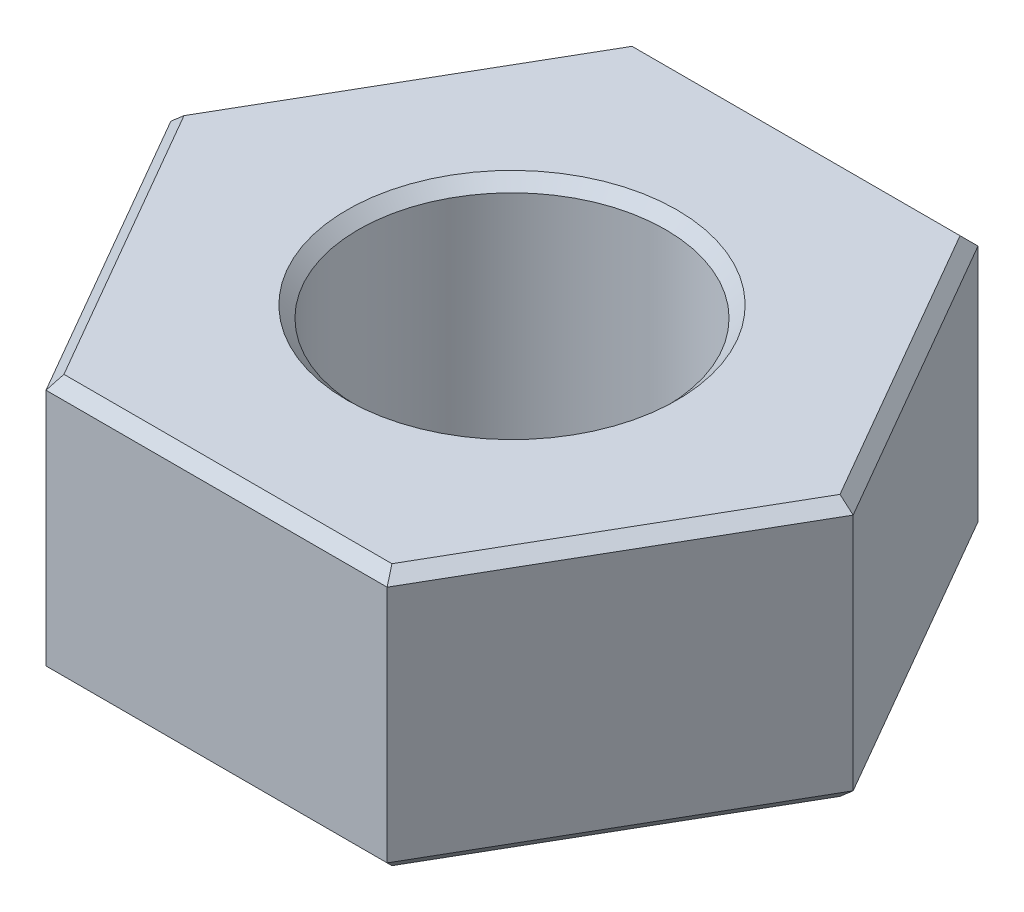
ISO-10303-21;
HEADER;
FILE_DESCRIPTION(('STEP AP214'),'2;1');
FILE_NAME('part.step','',(''),(''),'','','');
FILE_SCHEMA(('AUTOMOTIVE_DESIGN { 1 0 10303 214 1 1 1 1 }'));
ENDSEC;
DATA;
#1=APPLICATION_CONTEXT('core data for automotive mechanical design processes');
#2=APPLICATION_PROTOCOL_DEFINITION('international standard','automotive_design',2000,#1);
#3=PRODUCT_CONTEXT('',#1,'mechanical');
#4=PRODUCT('Part','Part','',(#3));
#5=PRODUCT_RELATED_PRODUCT_CATEGORY('part','',(#4));
#6=PRODUCT_DEFINITION_FORMATION('','',#4);
#7=PRODUCT_DEFINITION_CONTEXT('part definition',#1,'design');
#8=PRODUCT_DEFINITION('design','',#6,#7);
#9=PRODUCT_DEFINITION_SHAPE('','',#8);
#10=(LENGTH_UNIT() NAMED_UNIT(*) SI_UNIT(.MILLI.,.METRE.));
#11=(NAMED_UNIT(*) PLANE_ANGLE_UNIT() SI_UNIT($,.RADIAN.));
#12=(NAMED_UNIT(*) SI_UNIT($,.STERADIAN.) SOLID_ANGLE_UNIT());
#13=UNCERTAINTY_MEASURE_WITH_UNIT(LENGTH_MEASURE(1.E-05),#10,'distance_accuracy_value','');
#14=(GEOMETRIC_REPRESENTATION_CONTEXT(3) GLOBAL_UNCERTAINTY_ASSIGNED_CONTEXT((#13)) GLOBAL_UNIT_ASSIGNED_CONTEXT((#10,
#11,#12)) REPRESENTATION_CONTEXT('',''));
#15=CARTESIAN_POINT('',(0.,0.,0.));
#16=DIRECTION('',(0.,0.,1.));
#17=DIRECTION('',(1.,0.,0.));
#18=AXIS2_PLACEMENT_3D('',#15,#16,#17);
#19=CARTESIAN_POINT('',(0.,2.3,0.));
#20=DIRECTION('',(0.,1.,0.));
#21=DIRECTION('',(0.,0.,1.));
#22=AXIS2_PLACEMENT_3D('',#19,#20,#21);
#23=PLANE('',#22);
#24=CARTESIAN_POINT('',(0.,2.3,0.));
#25=DIRECTION('',(0.,1.,0.));
#26=DIRECTION('',(0.,0.,1.));
#27=AXIS2_PLACEMENT_3D('',#24,#25,#26);
#28=CIRCLE('',#27,1.45);
#29=CARTESIAN_POINT('',(0.,2.3,1.45));
#30=VERTEX_POINT('',#29);
#31=EDGE_CURVE('E11',#30,#30,#28,.F.);
#32=ORIENTED_EDGE('',*,*,#31,.T.);
#33=EDGE_LOOP('',(#32));
#34=FACE_BOUND('',#33,.T.);
#35=DIRECTION('',(-0.5,0.,0.866025403784439));
#36=VECTOR('',#35,1.);
#37=CARTESIAN_POINT('',(-2.91339745962156,2.3,0.0500000000000001));
#38=LINE('',#37,#36);
#39=CARTESIAN_POINT('',(-1.44226497308104,2.3,-2.49807621135332));
#40=VERTEX_POINT('',#39);
#41=CARTESIAN_POINT('',(-2.88452994616207,2.3,0.));
#42=VERTEX_POINT('',#41);
#43=EDGE_CURVE('E52',#40,#42,#38,.T.);
#44=ORIENTED_EDGE('',*,*,#43,.T.);
#45=DIRECTION('',(0.5,0.,0.866025403784439));
#46=VECTOR('',#45,1.);
#47=CARTESIAN_POINT('',(-1.41339745962156,2.3,2.54807621135332));
#48=LINE('',#47,#46);
#49=CARTESIAN_POINT('',(-1.44226497308104,2.3,2.49807621135332));
#50=VERTEX_POINT('',#49);
#51=EDGE_CURVE('E44',#42,#50,#48,.T.);
#52=ORIENTED_EDGE('',*,*,#51,.T.);
#53=DIRECTION('',(1.,0.,0.));
#54=VECTOR('',#53,1.);
#55=CARTESIAN_POINT('',(1.5,2.3,2.49807621135332));
#56=LINE('',#55,#54);
#57=CARTESIAN_POINT('',(1.44226497308104,2.3,2.49807621135332));
#58=VERTEX_POINT('',#57);
#59=EDGE_CURVE('E191',#50,#58,#56,.T.);
#60=ORIENTED_EDGE('',*,*,#59,.T.);
#61=DIRECTION('',(0.5,0.,-0.866025403784439));
#62=VECTOR('',#61,1.);
#63=CARTESIAN_POINT('',(2.91339745962156,2.3,-0.0499999999999996));
#64=LINE('',#63,#62);
#65=CARTESIAN_POINT('',(2.88452994616207,2.3,0.));
#66=VERTEX_POINT('',#65);
#67=EDGE_CURVE('E193',#58,#66,#64,.T.);
#68=ORIENTED_EDGE('',*,*,#67,.T.);
#69=DIRECTION('',(-0.5,0.,-0.866025403784439));
#70=VECTOR('',#69,1.);
#71=CARTESIAN_POINT('',(1.41339745962156,2.3,-2.54807621135332));
#72=LINE('',#71,#70);
#73=CARTESIAN_POINT('',(1.44226497308104,2.3,-2.49807621135332));
#74=VERTEX_POINT('',#73);
#75=EDGE_CURVE('E195',#66,#74,#72,.T.);
#76=ORIENTED_EDGE('',*,*,#75,.T.);
#77=DIRECTION('',(-1.,0.,0.));
#78=VECTOR('',#77,1.);
#79=CARTESIAN_POINT('',(-1.5,2.3,-2.49807621135332));
#80=LINE('',#79,#78);
#81=EDGE_CURVE('E57',#74,#40,#80,.T.);
#82=ORIENTED_EDGE('',*,*,#81,.T.);
#83=EDGE_LOOP('',(#44,#52,#60,#68,#76,#82));
#84=FACE_BOUND('',#83,.T.);
#85=ADVANCED_FACE('F35',(#34,#84),#23,.T.);
#86=CARTESIAN_POINT('',(0.,0.,0.));
#87=DIRECTION('',(0.,1.,0.));
#88=DIRECTION('',(0.,0.,1.));
#89=AXIS2_PLACEMENT_3D('',#86,#87,#88);
#90=PLANE('',#89);
#91=CARTESIAN_POINT('',(0.,0.,0.));
#92=DIRECTION('',(0.,1.,0.));
#93=DIRECTION('',(0.,0.,1.));
#94=AXIS2_PLACEMENT_3D('',#91,#92,#93);
#95=CIRCLE('',#94,1.45);
#96=CARTESIAN_POINT('',(0.,0.,1.45));
#97=VERTEX_POINT('',#96);
#98=EDGE_CURVE('E153',#97,#97,#95,.T.);
#99=ORIENTED_EDGE('',*,*,#98,.T.);
#100=EDGE_LOOP('',(#99));
#101=FACE_BOUND('',#100,.T.);
#102=DIRECTION('',(1.,0.,0.));
#103=VECTOR('',#102,1.);
#104=CARTESIAN_POINT('',(0.,0.,-2.49807621135332));
#105=LINE('',#104,#103);
#106=CARTESIAN_POINT('',(-1.44226497308104,0.,-2.49807621135332));
#107=VERTEX_POINT('',#106);
#108=CARTESIAN_POINT('',(1.44226497308104,0.,-2.49807621135332));
#109=VERTEX_POINT('',#108);
#110=EDGE_CURVE('E152',#107,#109,#105,.T.);
#111=ORIENTED_EDGE('',*,*,#110,.T.);
#112=DIRECTION('',(0.5,0.,0.866025403784439));
#113=VECTOR('',#112,1.);
#114=CARTESIAN_POINT('',(2.16339745962156,0.,-1.24903810567666));
#115=LINE('',#114,#113);
#116=CARTESIAN_POINT('',(2.88452994616207,0.,0.));
#117=VERTEX_POINT('',#116);
#118=EDGE_CURVE('E131',#109,#117,#115,.T.);
#119=ORIENTED_EDGE('',*,*,#118,.T.);
#120=DIRECTION('',(-0.5,0.,0.866025403784439));
#121=VECTOR('',#120,1.);
#122=CARTESIAN_POINT('',(2.16339745962156,0.,1.24903810567666));
#123=LINE('',#122,#121);
#124=CARTESIAN_POINT('',(1.44226497308104,0.,2.49807621135332));
#125=VERTEX_POINT('',#124);
#126=EDGE_CURVE('E141',#117,#125,#123,.T.);
#127=ORIENTED_EDGE('',*,*,#126,.T.);
#128=DIRECTION('',(-1.,0.,0.));
#129=VECTOR('',#128,1.);
#130=CARTESIAN_POINT('',(0.,0.,2.49807621135331));
#131=LINE('',#130,#129);
#132=CARTESIAN_POINT('',(-1.44226497308104,0.,2.49807621135331));
#133=VERTEX_POINT('',#132);
#134=EDGE_CURVE('E147',#125,#133,#131,.T.);
#135=ORIENTED_EDGE('',*,*,#134,.T.);
#136=DIRECTION('',(-0.5,0.,-0.866025403784439));
#137=VECTOR('',#136,1.);
#138=CARTESIAN_POINT('',(-2.16339745962155,0.,1.24903810567666));
#139=LINE('',#138,#137);
#140=CARTESIAN_POINT('',(-2.88452994616207,0.,0.));
#141=VERTEX_POINT('',#140);
#142=EDGE_CURVE('E251',#133,#141,#139,.T.);
#143=ORIENTED_EDGE('',*,*,#142,.T.);
#144=DIRECTION('',(0.5,0.,-0.866025403784439));
#145=VECTOR('',#144,1.);
#146=CARTESIAN_POINT('',(-2.16339745962156,0.,-1.24903810567666));
#147=LINE('',#146,#145);
#148=EDGE_CURVE('E158',#141,#107,#147,.T.);
#149=ORIENTED_EDGE('',*,*,#148,.T.);
#150=EDGE_LOOP('',(#111,#119,#127,#135,#143,#149));
#151=FACE_BOUND('',#150,.T.);
#152=ADVANCED_FACE('F150',(#101,#151),#90,.F.);
#153=CARTESIAN_POINT('',(1.5,2.3,2.59807621135332));
#154=DIRECTION('',(-0.866025403784439,0.,-0.5));
#155=DIRECTION('',(-0.5,0.,0.866025403784439));
#156=AXIS2_PLACEMENT_3D('',#153,#154,#155);
#157=PLANE('',#156);
#158=DIRECTION('',(0.,-1.,0.));
#159=VECTOR('',#158,1.);
#160=CARTESIAN_POINT('',(1.5,2.3,2.59807621135332));
#161=LINE('',#160,#159);
#162=CARTESIAN_POINT('',(1.5,2.2,2.59807621135332));
#163=VERTEX_POINT('',#162);
#164=CARTESIAN_POINT('',(1.5,0.1,2.59807621135332));
#165=VERTEX_POINT('',#164);
#166=EDGE_CURVE('E210',#163,#165,#161,.T.);
#167=ORIENTED_EDGE('',*,*,#166,.T.);
#168=DIRECTION('',(0.5,0.,-0.866025403784439));
#169=VECTOR('',#168,1.);
#170=CARTESIAN_POINT('',(1.5,0.1,2.59807621135332));
#171=LINE('',#170,#169);
#172=CARTESIAN_POINT('',(3.,0.1,0.));
#173=VERTEX_POINT('',#172);
#174=EDGE_CURVE('E189',#165,#173,#171,.T.);
#175=ORIENTED_EDGE('',*,*,#174,.T.);
#176=DIRECTION('',(0.,-1.,0.));
#177=VECTOR('',#176,1.);
#178=CARTESIAN_POINT('',(3.,2.3,0.));
#179=LINE('',#178,#177);
#180=CARTESIAN_POINT('',(3.,2.2,0.));
#181=VERTEX_POINT('',#180);
#182=EDGE_CURVE('E148',#181,#173,#179,.T.);
#183=ORIENTED_EDGE('',*,*,#182,.F.);
#184=DIRECTION('',(-0.5,0.,0.866025403784439));
#185=VECTOR('',#184,1.);
#186=CARTESIAN_POINT('',(1.5,2.2,2.59807621135332));
#187=LINE('',#186,#185);
#188=EDGE_CURVE('E187',#181,#163,#187,.T.);
#189=ORIENTED_EDGE('',*,*,#188,.T.);
#190=EDGE_LOOP('',(#167,#175,#183,#189));
#191=FACE_BOUND('',#190,.T.);
#192=ADVANCED_FACE('F243',(#191),#157,.F.);
#193=CARTESIAN_POINT('',(3.,2.3,0.));
#194=DIRECTION('',(-0.866025403784439,0.,0.5));
#195=DIRECTION('',(0.5,0.,0.866025403784439));
#196=AXIS2_PLACEMENT_3D('',#193,#194,#195);
#197=PLANE('',#196);
#198=ORIENTED_EDGE('',*,*,#182,.T.);
#199=DIRECTION('',(-0.5,0.,-0.866025403784439));
#200=VECTOR('',#199,1.);
#201=CARTESIAN_POINT('',(3.,0.1,0.));
#202=LINE('',#201,#200);
#203=CARTESIAN_POINT('',(1.5,0.1,-2.59807621135332));
#204=VERTEX_POINT('',#203);
#205=EDGE_CURVE('E134',#173,#204,#202,.T.);
#206=ORIENTED_EDGE('',*,*,#205,.T.);
#207=DIRECTION('',(0.,-1.,0.));
#208=VECTOR('',#207,1.);
#209=CARTESIAN_POINT('',(1.5,2.3,-2.59807621135332));
#210=LINE('',#209,#208);
#211=CARTESIAN_POINT('',(1.5,2.2,-2.59807621135332));
#212=VERTEX_POINT('',#211);
#213=EDGE_CURVE('E240',#212,#204,#210,.T.);
#214=ORIENTED_EDGE('',*,*,#213,.F.);
#215=DIRECTION('',(0.5,0.,0.866025403784439));
#216=VECTOR('',#215,1.);
#217=CARTESIAN_POINT('',(3.,2.2,0.));
#218=LINE('',#217,#216);
#219=EDGE_CURVE('E167',#212,#181,#218,.T.);
#220=ORIENTED_EDGE('',*,*,#219,.T.);
#221=EDGE_LOOP('',(#198,#206,#214,#220));
#222=FACE_BOUND('',#221,.T.);
#223=ADVANCED_FACE('F238',(#222),#197,.F.);
#224=CARTESIAN_POINT('',(1.5,2.3,-2.59807621135332));
#225=DIRECTION('',(0.,0.,1.));
#226=DIRECTION('',(1.,0.,0.));
#227=AXIS2_PLACEMENT_3D('',#224,#225,#226);
#228=PLANE('',#227);
#229=ORIENTED_EDGE('',*,*,#213,.T.);
#230=DIRECTION('',(-1.,0.,0.));
#231=VECTOR('',#230,1.);
#232=CARTESIAN_POINT('',(1.5,0.1,-2.59807621135332));
#233=LINE('',#232,#231);
#234=CARTESIAN_POINT('',(-1.5,0.1,-2.59807621135332));
#235=VERTEX_POINT('',#234);
#236=EDGE_CURVE('E172',#204,#235,#233,.T.);
#237=ORIENTED_EDGE('',*,*,#236,.T.);
#238=DIRECTION('',(0.,-1.,0.));
#239=VECTOR('',#238,1.);
#240=CARTESIAN_POINT('',(-1.5,2.3,-2.59807621135332));
#241=LINE('',#240,#239);
#242=CARTESIAN_POINT('',(-1.5,2.2,-2.59807621135332));
#243=VERTEX_POINT('',#242);
#244=EDGE_CURVE('E246',#243,#235,#241,.T.);
#245=ORIENTED_EDGE('',*,*,#244,.F.);
#246=DIRECTION('',(1.,0.,0.));
#247=VECTOR('',#246,1.);
#248=CARTESIAN_POINT('',(1.5,2.2,-2.59807621135332));
#249=LINE('',#248,#247);
#250=EDGE_CURVE('E170',#243,#212,#249,.T.);
#251=ORIENTED_EDGE('',*,*,#250,.T.);
#252=EDGE_LOOP('',(#229,#237,#245,#251));
#253=FACE_BOUND('',#252,.T.);
#254=ADVANCED_FACE('F265',(#253),#228,.F.);
#255=CARTESIAN_POINT('',(-1.5,2.3,-2.59807621135332));
#256=DIRECTION('',(0.866025403784439,0.,0.5));
#257=DIRECTION('',(0.5,0.,-0.866025403784439));
#258=AXIS2_PLACEMENT_3D('',#255,#256,#257);
#259=PLANE('',#258);
#260=ORIENTED_EDGE('',*,*,#244,.T.);
#261=DIRECTION('',(-0.5,0.,0.866025403784439));
#262=VECTOR('',#261,1.);
#263=CARTESIAN_POINT('',(-1.5,0.1,-2.59807621135332));
#264=LINE('',#263,#262);
#265=CARTESIAN_POINT('',(-3.,0.1,0.));
#266=VERTEX_POINT('',#265);
#267=EDGE_CURVE('E176',#235,#266,#264,.T.);
#268=ORIENTED_EDGE('',*,*,#267,.T.);
#269=DIRECTION('',(0.,-1.,0.));
#270=VECTOR('',#269,1.);
#271=CARTESIAN_POINT('',(-3.,2.3,0.));
#272=LINE('',#271,#270);
#273=CARTESIAN_POINT('',(-3.,2.2,0.));
#274=VERTEX_POINT('',#273);
#275=EDGE_CURVE('E267',#274,#266,#272,.T.);
#276=ORIENTED_EDGE('',*,*,#275,.F.);
#277=DIRECTION('',(0.5,0.,-0.866025403784439));
#278=VECTOR('',#277,1.);
#279=CARTESIAN_POINT('',(-1.5,2.2,-2.59807621135332));
#280=LINE('',#279,#278);
#281=EDGE_CURVE('E174',#274,#243,#280,.T.);
#282=ORIENTED_EDGE('',*,*,#281,.T.);
#283=EDGE_LOOP('',(#260,#268,#276,#282));
#284=FACE_BOUND('',#283,.T.);
#285=ADVANCED_FACE('F298',(#284),#259,.F.);
#286=CARTESIAN_POINT('',(-3.,2.3,0.));
#287=DIRECTION('',(0.866025403784439,0.,-0.5));
#288=DIRECTION('',(-0.5,0.,-0.866025403784439));
#289=AXIS2_PLACEMENT_3D('',#286,#287,#288);
#290=PLANE('',#289);
#291=ORIENTED_EDGE('',*,*,#275,.T.);
#292=DIRECTION('',(0.5,0.,0.866025403784439));
#293=VECTOR('',#292,1.);
#294=CARTESIAN_POINT('',(-3.,0.1,0.));
#295=LINE('',#294,#293);
#296=CARTESIAN_POINT('',(-1.5,0.1,2.59807621135332));
#297=VERTEX_POINT('',#296);
#298=EDGE_CURVE('E181',#266,#297,#295,.T.);
#299=ORIENTED_EDGE('',*,*,#298,.T.);
#300=DIRECTION('',(0.,-1.,0.));
#301=VECTOR('',#300,1.);
#302=CARTESIAN_POINT('',(-1.5,2.3,2.59807621135332));
#303=LINE('',#302,#301);
#304=CARTESIAN_POINT('',(-1.5,2.2,2.59807621135332));
#305=VERTEX_POINT('',#304);
#306=EDGE_CURVE('E269',#305,#297,#303,.T.);
#307=ORIENTED_EDGE('',*,*,#306,.F.);
#308=DIRECTION('',(-0.5,0.,-0.866025403784439));
#309=VECTOR('',#308,1.);
#310=CARTESIAN_POINT('',(-3.,2.2,0.));
#311=LINE('',#310,#309);
#312=EDGE_CURVE('E178',#305,#274,#311,.T.);
#313=ORIENTED_EDGE('',*,*,#312,.T.);
#314=EDGE_LOOP('',(#291,#299,#307,#313));
#315=FACE_BOUND('',#314,.T.);
#316=ADVANCED_FACE('F285',(#315),#290,.F.);
#317=CARTESIAN_POINT('',(-1.5,2.3,2.59807621135332));
#318=DIRECTION('',(0.,0.,-1.));
#319=DIRECTION('',(-1.,0.,0.));
#320=AXIS2_PLACEMENT_3D('',#317,#318,#319);
#321=PLANE('',#320);
#322=ORIENTED_EDGE('',*,*,#306,.T.);
#323=DIRECTION('',(1.,0.,0.));
#324=VECTOR('',#323,1.);
#325=CARTESIAN_POINT('',(-1.5,0.1,2.59807621135332));
#326=LINE('',#325,#324);
#327=EDGE_CURVE('E185',#297,#165,#326,.T.);
#328=ORIENTED_EDGE('',*,*,#327,.T.);
#329=ORIENTED_EDGE('',*,*,#166,.F.);
#330=DIRECTION('',(-1.,0.,0.));
#331=VECTOR('',#330,1.);
#332=CARTESIAN_POINT('',(-1.5,2.2,2.59807621135332));
#333=LINE('',#332,#331);
#334=EDGE_CURVE('E183',#163,#305,#333,.T.);
#335=ORIENTED_EDGE('',*,*,#334,.T.);
#336=EDGE_LOOP('',(#322,#328,#329,#335));
#337=FACE_BOUND('',#336,.T.);
#338=ADVANCED_FACE('F288',(#337),#321,.F.);
#339=CARTESIAN_POINT('',(0.,2.3,0.));
#340=DIRECTION('',(0.,-1.,0.));
#341=DIRECTION('',(0.,0.,-1.));
#342=AXIS2_PLACEMENT_3D('',#339,#340,#341);
#343=CYLINDRICAL_SURFACE('',#342,1.35);
#344=CARTESIAN_POINT('',(0.,0.1,0.));
#345=DIRECTION('',(0.,1.,0.));
#346=DIRECTION('',(0.,0.,1.));
#347=AXIS2_PLACEMENT_3D('',#344,#345,#346);
#348=CIRCLE('',#347,1.35);
#349=CARTESIAN_POINT('',(0.,0.1,1.35));
#350=VERTEX_POINT('',#349);
#351=EDGE_CURVE('E164',#350,#350,#348,.F.);
#352=ORIENTED_EDGE('',*,*,#351,.T.);
#353=EDGE_LOOP('',(#352));
#354=FACE_BOUND('',#353,.T.);
#355=CARTESIAN_POINT('',(0.,2.2,0.));
#356=DIRECTION('',(0.,1.,0.));
#357=DIRECTION('',(0.,0.,1.));
#358=AXIS2_PLACEMENT_3D('',#355,#356,#357);
#359=CIRCLE('',#358,1.35);
#360=CARTESIAN_POINT('',(0.,2.2,1.35));
#361=VERTEX_POINT('',#360);
#362=EDGE_CURVE('E156',#361,#361,#359,.T.);
#363=ORIENTED_EDGE('',*,*,#362,.T.);
#364=EDGE_LOOP('',(#363));
#365=FACE_BOUND('',#364,.T.);
#366=ADVANCED_FACE('F319',(#354,#365),#343,.F.);
#367=CARTESIAN_POINT('',(0.,0.,0.));
#368=DIRECTION('',(0.,-1.,0.));
#369=DIRECTION('',(0.,0.,-1.));
#370=AXIS2_PLACEMENT_3D('',#367,#368,#369);
#371=CONICAL_SURFACE('',#370,1.45,0.785398163397446);
#372=ORIENTED_EDGE('',*,*,#351,.F.);
#373=EDGE_LOOP('',(#372));
#374=FACE_BOUND('',#373,.T.);
#375=ORIENTED_EDGE('',*,*,#98,.F.);
#376=EDGE_LOOP('',(#375));
#377=FACE_BOUND('',#376,.T.);
#378=ADVANCED_FACE('F333',(#374,#377),#371,.F.);
#379=CARTESIAN_POINT('',(-3.,0.1,0.));
#380=DIRECTION('',(0.612372435695794,0.707106781186549,-0.353553390593273));
#381=DIRECTION('',(0.5,0.,0.866025403784439));
#382=AXIS2_PLACEMENT_3D('',#379,#380,#381);
#383=PLANE('',#382);
#384=DIRECTION('',(0.755928946018456,-0.654653670707976,0.));
#385=VECTOR('',#384,1.);
#386=CARTESIAN_POINT('',(-3.,0.1,0.));
#387=LINE('',#386,#385);
#388=EDGE_CURVE('E204',#141,#266,#387,.F.);
#389=ORIENTED_EDGE('',*,*,#388,.F.);
#390=ORIENTED_EDGE('',*,*,#142,.F.);
#391=DIRECTION('',(0.377964473009228,-0.654653670707976,-0.654653670707978));
#392=VECTOR('',#391,1.);
#393=CARTESIAN_POINT('',(-1.5,0.1,2.59807621135332));
#394=LINE('',#393,#392);
#395=EDGE_CURVE('E207',#297,#133,#394,.T.);
#396=ORIENTED_EDGE('',*,*,#395,.F.);
#397=ORIENTED_EDGE('',*,*,#298,.F.);
#398=EDGE_LOOP('',(#389,#390,#396,#397));
#399=FACE_BOUND('',#398,.T.);
#400=ADVANCED_FACE('F281',(#399),#383,.F.);
#401=CARTESIAN_POINT('',(-1.5,0.1,2.59807621135332));
#402=DIRECTION('',(0.,0.707106781186548,-0.707106781186547));
#403=DIRECTION('',(1.,0.,0.));
#404=AXIS2_PLACEMENT_3D('',#401,#402,#403);
#405=PLANE('',#404);
#406=ORIENTED_EDGE('',*,*,#395,.T.);
#407=ORIENTED_EDGE('',*,*,#134,.F.);
#408=DIRECTION('',(-0.377964473009223,-0.654653670707977,-0.654653670707979));
#409=VECTOR('',#408,1.);
#410=CARTESIAN_POINT('',(1.5,0.1,2.59807621135332));
#411=LINE('',#410,#409);
#412=EDGE_CURVE('E144',#165,#125,#411,.T.);
#413=ORIENTED_EDGE('',*,*,#412,.F.);
#414=ORIENTED_EDGE('',*,*,#327,.F.);
#415=EDGE_LOOP('',(#406,#407,#413,#414));
#416=FACE_BOUND('',#415,.T.);
#417=ADVANCED_FACE('F278',(#416),#405,.F.);
#418=CARTESIAN_POINT('',(-1.5,0.1,-2.59807621135332));
#419=DIRECTION('',(0.612372435695794,0.707106781186549,0.353553390593273));
#420=DIRECTION('',(-0.5,0.,0.866025403784439));
#421=AXIS2_PLACEMENT_3D('',#418,#419,#420);
#422=PLANE('',#421);
#423=ORIENTED_EDGE('',*,*,#388,.T.);
#424=ORIENTED_EDGE('',*,*,#267,.F.);
#425=DIRECTION('',(0.37796447300923,-0.654653670707977,0.654653670707976));
#426=VECTOR('',#425,1.);
#427=CARTESIAN_POINT('',(-1.5,0.1,-2.59807621135332));
#428=LINE('',#427,#426);
#429=EDGE_CURVE('E137',#107,#235,#428,.F.);
#430=ORIENTED_EDGE('',*,*,#429,.F.);
#431=ORIENTED_EDGE('',*,*,#148,.F.);
#432=EDGE_LOOP('',(#423,#424,#430,#431));
#433=FACE_BOUND('',#432,.T.);
#434=ADVANCED_FACE('F258',(#433),#422,.F.);
#435=CARTESIAN_POINT('',(1.5,0.1,2.59807621135332));
#436=DIRECTION('',(-0.612372435695796,0.707106781186546,-0.353553390593274));
#437=DIRECTION('',(0.5,0.,-0.866025403784439));
#438=AXIS2_PLACEMENT_3D('',#435,#436,#437);
#439=PLANE('',#438);
#440=ORIENTED_EDGE('',*,*,#412,.T.);
#441=ORIENTED_EDGE('',*,*,#126,.F.);
#442=DIRECTION('',(0.755928946018453,0.654653670707979,0.));
#443=VECTOR('',#442,1.);
#444=CARTESIAN_POINT('',(2.14285714285715,-0.64230748895809,0.));
#445=LINE('',#444,#443);
#446=EDGE_CURVE('E127',#173,#117,#445,.F.);
#447=ORIENTED_EDGE('',*,*,#446,.F.);
#448=ORIENTED_EDGE('',*,*,#174,.F.);
#449=EDGE_LOOP('',(#440,#441,#447,#448));
#450=FACE_BOUND('',#449,.T.);
#451=ADVANCED_FACE('F142',(#450),#439,.F.);
#452=CARTESIAN_POINT('',(1.5,0.1,-2.59807621135332));
#453=DIRECTION('',(0.,0.707106781186547,0.707106781186547));
#454=DIRECTION('',(-1.,0.,0.));
#455=AXIS2_PLACEMENT_3D('',#452,#453,#454);
#456=PLANE('',#455);
#457=ORIENTED_EDGE('',*,*,#429,.T.);
#458=ORIENTED_EDGE('',*,*,#236,.F.);
#459=DIRECTION('',(-0.377964473009224,-0.654653670707978,0.654653670707978));
#460=VECTOR('',#459,1.);
#461=CARTESIAN_POINT('',(1.5,0.1,-2.59807621135332));
#462=LINE('',#461,#460);
#463=EDGE_CURVE('E138',#109,#204,#462,.F.);
#464=ORIENTED_EDGE('',*,*,#463,.F.);
#465=ORIENTED_EDGE('',*,*,#110,.F.);
#466=EDGE_LOOP('',(#457,#458,#464,#465));
#467=FACE_BOUND('',#466,.T.);
#468=ADVANCED_FACE('F261',(#467),#456,.F.);
#469=CARTESIAN_POINT('',(3.,0.1,0.));
#470=DIRECTION('',(-0.612372435695796,0.707106781186546,0.353553390593274));
#471=DIRECTION('',(-0.5,0.,-0.866025403784439));
#472=AXIS2_PLACEMENT_3D('',#469,#470,#471);
#473=PLANE('',#472);
#474=ORIENTED_EDGE('',*,*,#446,.T.);
#475=ORIENTED_EDGE('',*,*,#118,.F.);
#476=ORIENTED_EDGE('',*,*,#463,.T.);
#477=ORIENTED_EDGE('',*,*,#205,.F.);
#478=EDGE_LOOP('',(#474,#475,#476,#477));
#479=FACE_BOUND('',#478,.T.);
#480=ADVANCED_FACE('F129',(#479),#473,.F.);
#481=CARTESIAN_POINT('',(0.,2.2,0.));
#482=DIRECTION('',(0.,1.,0.));
#483=DIRECTION('',(0.,0.,1.));
#484=AXIS2_PLACEMENT_3D('',#481,#482,#483);
#485=CONICAL_SURFACE('',#484,1.35,0.78539816339745);
#486=ORIENTED_EDGE('',*,*,#31,.F.);
#487=EDGE_LOOP('',(#486));
#488=FACE_BOUND('',#487,.T.);
#489=ORIENTED_EDGE('',*,*,#362,.F.);
#490=EDGE_LOOP('',(#489));
#491=FACE_BOUND('',#490,.T.);
#492=ADVANCED_FACE('F339',(#488,#491),#485,.F.);
#493=CARTESIAN_POINT('',(2.16339745962156,2.3,-1.24903810567666));
#494=DIRECTION('',(0.612372435695797,0.707106781186544,-0.353553390593275));
#495=DIRECTION('',(0.5,0.,0.866025403784439));
#496=AXIS2_PLACEMENT_3D('',#493,#494,#495);
#497=PLANE('',#496);
#498=DIRECTION('',(-0.755928946018451,0.654653670707981,0.));
#499=VECTOR('',#498,1.);
#500=CARTESIAN_POINT('',(2.4724542395675,2.65686803019333,0.));
#501=LINE('',#500,#499);
#502=EDGE_CURVE('E220',#181,#66,#501,.T.);
#503=ORIENTED_EDGE('',*,*,#502,.F.);
#504=ORIENTED_EDGE('',*,*,#219,.F.);
#505=DIRECTION('',(-0.377964473009226,0.65465367070798,0.654653670707975));
#506=VECTOR('',#505,1.);
#507=CARTESIAN_POINT('',(1.23622711978375,2.65686803019333,-2.14120818115999));
#508=LINE('',#507,#506);
#509=EDGE_CURVE('E39',#74,#212,#508,.F.);
#510=ORIENTED_EDGE('',*,*,#509,.F.);
#511=ORIENTED_EDGE('',*,*,#75,.F.);
#512=EDGE_LOOP('',(#503,#504,#510,#511));
#513=FACE_BOUND('',#512,.T.);
#514=ADVANCED_FACE('F37',(#513),#497,.T.);
#515=CARTESIAN_POINT('',(0.,2.3,-2.49807621135332));
#516=DIRECTION('',(0.,0.707106781186544,-0.707106781186551));
#517=DIRECTION('',(1.,0.,0.));
#518=AXIS2_PLACEMENT_3D('',#515,#516,#517);
#519=PLANE('',#518);
#520=ORIENTED_EDGE('',*,*,#509,.T.);
#521=ORIENTED_EDGE('',*,*,#250,.F.);
#522=DIRECTION('',(0.37796447300923,0.654653670707979,0.654653670707974));
#523=VECTOR('',#522,1.);
#524=CARTESIAN_POINT('',(-1.23622711978374,2.65686803019333,-2.14120818115999));
#525=LINE('',#524,#523);
#526=EDGE_CURVE('E218',#40,#243,#525,.F.);
#527=ORIENTED_EDGE('',*,*,#526,.F.);
#528=ORIENTED_EDGE('',*,*,#81,.F.);
#529=EDGE_LOOP('',(#520,#521,#527,#528));
#530=FACE_BOUND('',#529,.T.);
#531=ADVANCED_FACE('F230',(#530),#519,.T.);
#532=CARTESIAN_POINT('',(2.16339745962156,2.3,1.24903810567666));
#533=DIRECTION('',(0.612372435695798,0.707106781186544,0.353553390593275));
#534=DIRECTION('',(-0.5,0.,0.866025403784439));
#535=AXIS2_PLACEMENT_3D('',#532,#533,#534);
#536=PLANE('',#535);
#537=ORIENTED_EDGE('',*,*,#502,.T.);
#538=ORIENTED_EDGE('',*,*,#67,.F.);
#539=DIRECTION('',(-0.377964473009224,0.65465367070798,-0.654653670707976));
#540=VECTOR('',#539,1.);
#541=CARTESIAN_POINT('',(1.23622711978375,2.65686803019333,2.14120818115999));
#542=LINE('',#541,#540);
#543=EDGE_CURVE('E215',#163,#58,#542,.T.);
#544=ORIENTED_EDGE('',*,*,#543,.F.);
#545=ORIENTED_EDGE('',*,*,#188,.F.);
#546=EDGE_LOOP('',(#537,#538,#544,#545));
#547=FACE_BOUND('',#546,.T.);
#548=ADVANCED_FACE('F302',(#547),#536,.T.);
#549=CARTESIAN_POINT('',(-2.16339745962156,2.3,-1.24903810567666));
#550=DIRECTION('',(-0.612372435695795,0.707106781186547,-0.353553390593274));
#551=DIRECTION('',(0.5,0.,-0.866025403784439));
#552=AXIS2_PLACEMENT_3D('',#549,#550,#551);
#553=PLANE('',#552);
#554=ORIENTED_EDGE('',*,*,#526,.T.);
#555=ORIENTED_EDGE('',*,*,#281,.F.);
#556=DIRECTION('',(0.755928946018452,0.65465367070798,0.));
#557=VECTOR('',#556,1.);
#558=CARTESIAN_POINT('',(-2.4724542395675,2.65686803019333,0.));
#559=LINE('',#558,#557);
#560=EDGE_CURVE('E213',#42,#274,#559,.F.);
#561=ORIENTED_EDGE('',*,*,#560,.F.);
#562=ORIENTED_EDGE('',*,*,#43,.F.);
#563=EDGE_LOOP('',(#554,#555,#561,#562));
#564=FACE_BOUND('',#563,.T.);
#565=ADVANCED_FACE('F300',(#564),#553,.T.);
#566=CARTESIAN_POINT('',(0.,2.3,2.49807621135332));
#567=DIRECTION('',(0.,0.707106781186545,0.70710678118655));
#568=DIRECTION('',(-1.,0.,0.));
#569=AXIS2_PLACEMENT_3D('',#566,#567,#568);
#570=PLANE('',#569);
#571=ORIENTED_EDGE('',*,*,#543,.T.);
#572=ORIENTED_EDGE('',*,*,#59,.F.);
#573=DIRECTION('',(-0.377964473009223,-0.654653670707981,0.654653670707976));
#574=VECTOR('',#573,1.);
#575=CARTESIAN_POINT('',(-1.23622711978375,2.65686803019333,2.14120818115999));
#576=LINE('',#575,#574);
#577=EDGE_CURVE('E211',#305,#50,#576,.F.);
#578=ORIENTED_EDGE('',*,*,#577,.F.);
#579=ORIENTED_EDGE('',*,*,#334,.F.);
#580=EDGE_LOOP('',(#571,#572,#578,#579));
#581=FACE_BOUND('',#580,.T.);
#582=ADVANCED_FACE('F292',(#581),#570,.T.);
#583=CARTESIAN_POINT('',(-2.16339745962156,2.3,1.24903810567666));
#584=DIRECTION('',(-0.612372435695798,0.707106781186543,0.353553390593276));
#585=DIRECTION('',(-0.5,0.,-0.866025403784439));
#586=AXIS2_PLACEMENT_3D('',#583,#584,#585);
#587=PLANE('',#586);
#588=ORIENTED_EDGE('',*,*,#560,.T.);
#589=ORIENTED_EDGE('',*,*,#312,.F.);
#590=ORIENTED_EDGE('',*,*,#577,.T.);
#591=ORIENTED_EDGE('',*,*,#51,.F.);
#592=EDGE_LOOP('',(#588,#589,#590,#591));
#593=FACE_BOUND('',#592,.T.);
#594=ADVANCED_FACE('F296',(#593),#587,.T.);
#595=CLOSED_SHELL('',(#85,#152,#192,#223,#254,#285,#316,#338,#366,#378,#400,#417,#434,#451,#468,
#480,#492,#514,#531,#548,#565,#582,#594));
#596=MANIFOLD_SOLID_BREP('B2',#595);
#597=ADVANCED_BREP_SHAPE_REPRESENTATION('',(#18,#596),#14);
#598=SHAPE_DEFINITION_REPRESENTATION(#9,#597);
ENDSEC;
END-ISO-10303-21;
